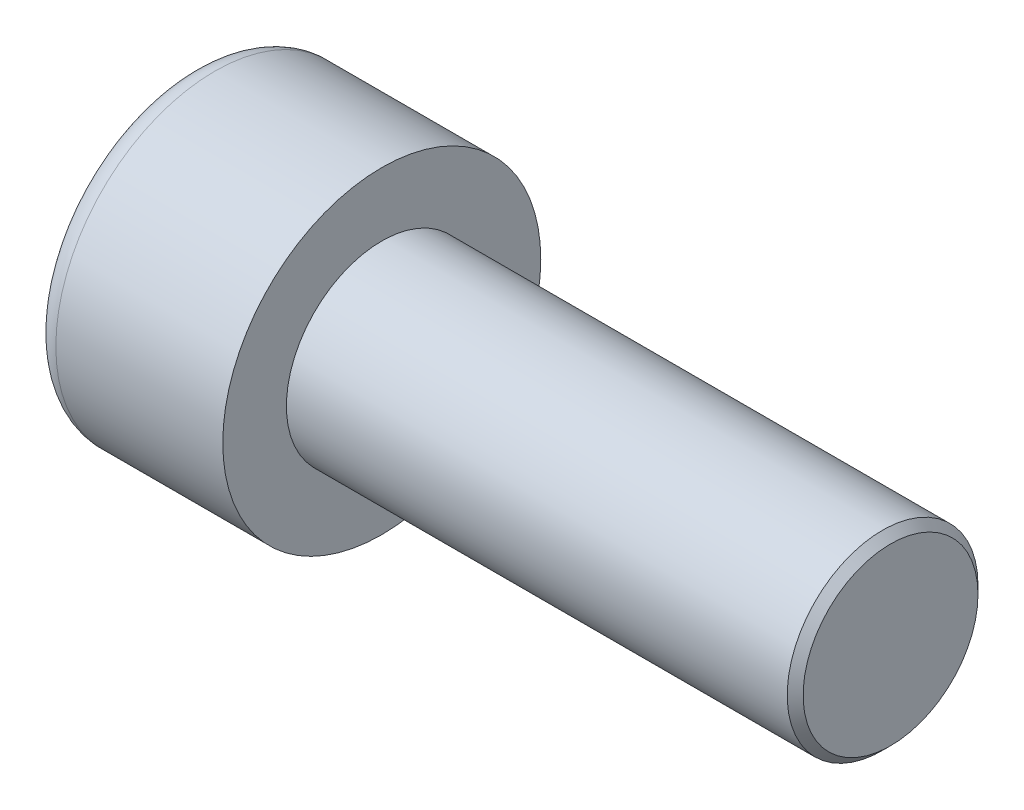
ISO-10303-21;
HEADER;
FILE_DESCRIPTION(('STEP AP214'),'2;1');
FILE_NAME('part.step','',(''),(''),'','','');
FILE_SCHEMA(('AUTOMOTIVE_DESIGN { 1 0 10303 214 1 1 1 1 }'));
ENDSEC;
DATA;
#1=APPLICATION_CONTEXT('core data for automotive mechanical design processes');
#2=APPLICATION_PROTOCOL_DEFINITION('international standard','automotive_design',2000,#1);
#3=PRODUCT_CONTEXT('',#1,'mechanical');
#4=PRODUCT('Part','Part','',(#3));
#5=PRODUCT_RELATED_PRODUCT_CATEGORY('part','',(#4));
#6=PRODUCT_DEFINITION_FORMATION('','',#4);
#7=PRODUCT_DEFINITION_CONTEXT('part definition',#1,'design');
#8=PRODUCT_DEFINITION('design','',#6,#7);
#9=PRODUCT_DEFINITION_SHAPE('','',#8);
#10=(LENGTH_UNIT() NAMED_UNIT(*) SI_UNIT(.MILLI.,.METRE.));
#11=(NAMED_UNIT(*) PLANE_ANGLE_UNIT() SI_UNIT($,.RADIAN.));
#12=(NAMED_UNIT(*) SI_UNIT($,.STERADIAN.) SOLID_ANGLE_UNIT());
#13=UNCERTAINTY_MEASURE_WITH_UNIT(LENGTH_MEASURE(1.E-05),#10,'distance_accuracy_value','');
#14=(GEOMETRIC_REPRESENTATION_CONTEXT(3) GLOBAL_UNCERTAINTY_ASSIGNED_CONTEXT((#13)) GLOBAL_UNIT_ASSIGNED_CONTEXT((#10,
#11,#12)) REPRESENTATION_CONTEXT('',''));
#15=CARTESIAN_POINT('',(0.,0.,0.));
#16=DIRECTION('',(0.,0.,1.));
#17=DIRECTION('',(1.,0.,0.));
#18=AXIS2_PLACEMENT_3D('',#15,#16,#17);
#19=CARTESIAN_POINT('',(3.,0.,-2.88675134594813));
#20=DIRECTION('',(1.,0.,0.));
#21=DIRECTION('',(0.,0.,-1.));
#22=AXIS2_PLACEMENT_3D('',#19,#20,#21);
#23=PLANE('',#22);
#24=CARTESIAN_POINT('',(3.,0.,0.));
#25=DIRECTION('',(1.,0.,0.));
#26=DIRECTION('',(0.,0.,-1.));
#27=AXIS2_PLACEMENT_3D('',#24,#25,#26);
#28=CIRCLE('',#27,2.5);
#29=CARTESIAN_POINT('',(3.,-1.25,-2.1650635094611));
#30=VERTEX_POINT('',#29);
#31=CARTESIAN_POINT('',(3.,-2.5,0.));
#32=VERTEX_POINT('',#31);
#33=EDGE_CURVE('E160',#30,#32,#28,.F.);
#34=ORIENTED_EDGE('',*,*,#33,.F.);
#35=DIRECTION('',(0.,0.866025403784439,-0.5));
#36=VECTOR('',#35,1.);
#37=CARTESIAN_POINT('',(3.,-2.5,-1.44337567297407));
#38=LINE('',#37,#36);
#39=CARTESIAN_POINT('',(3.,-2.5,-1.44337567297407));
#40=VERTEX_POINT('',#39);
#41=EDGE_CURVE('E168',#40,#30,#38,.T.);
#42=ORIENTED_EDGE('',*,*,#41,.F.);
#43=DIRECTION('',(0.,0.,-1.));
#44=VECTOR('',#43,1.);
#45=CARTESIAN_POINT('',(3.,-2.5,1.44337567297406));
#46=LINE('',#45,#44);
#47=EDGE_CURVE('E185',#32,#40,#46,.T.);
#48=ORIENTED_EDGE('',*,*,#47,.F.);
#49=EDGE_LOOP('',(#34,#42,#48));
#50=FACE_BOUND('',#49,.T.);
#51=ADVANCED_FACE('F37',(#50),#23,.F.);
#52=CARTESIAN_POINT('',(3.,-1.25,2.1650635094611));
#53=VERTEX_POINT('',#52);
#54=EDGE_CURVE('E290',#32,#53,#28,.F.);
#55=ORIENTED_EDGE('',*,*,#54,.F.);
#56=CARTESIAN_POINT('',(3.,-2.5,1.44337567297406));
#57=VERTEX_POINT('',#56);
#58=EDGE_CURVE('E186',#57,#32,#46,.T.);
#59=ORIENTED_EDGE('',*,*,#58,.F.);
#60=DIRECTION('',(0.,-0.866025403784438,-0.5));
#61=VECTOR('',#60,1.);
#62=CARTESIAN_POINT('',(3.,0.,2.88675134594813));
#63=LINE('',#62,#61);
#64=EDGE_CURVE('E181',#53,#57,#63,.T.);
#65=ORIENTED_EDGE('',*,*,#64,.F.);
#66=EDGE_LOOP('',(#55,#59,#65));
#67=FACE_BOUND('',#66,.T.);
#68=ADVANCED_FACE('F126',(#67),#23,.F.);
#69=CARTESIAN_POINT('',(3.,1.25,2.1650635094611));
#70=VERTEX_POINT('',#69);
#71=EDGE_CURVE('E286',#53,#70,#28,.F.);
#72=ORIENTED_EDGE('',*,*,#71,.F.);
#73=CARTESIAN_POINT('',(3.,0.,2.88675134594813));
#74=VERTEX_POINT('',#73);
#75=EDGE_CURVE('E182',#74,#53,#63,.T.);
#76=ORIENTED_EDGE('',*,*,#75,.F.);
#77=DIRECTION('',(0.,-0.866025403784439,0.5));
#78=VECTOR('',#77,1.);
#79=CARTESIAN_POINT('',(3.,2.5,1.44337567297406));
#80=LINE('',#79,#78);
#81=EDGE_CURVE('E177',#70,#74,#80,.T.);
#82=ORIENTED_EDGE('',*,*,#81,.F.);
#83=EDGE_LOOP('',(#72,#76,#82));
#84=FACE_BOUND('',#83,.T.);
#85=ADVANCED_FACE('F132',(#84),#23,.F.);
#86=CARTESIAN_POINT('',(3.,2.5,0.));
#87=VERTEX_POINT('',#86);
#88=EDGE_CURVE('E157',#70,#87,#28,.F.);
#89=ORIENTED_EDGE('',*,*,#88,.F.);
#90=CARTESIAN_POINT('',(3.,2.5,1.44337567297406));
#91=VERTEX_POINT('',#90);
#92=EDGE_CURVE('E178',#91,#70,#80,.T.);
#93=ORIENTED_EDGE('',*,*,#92,.F.);
#94=DIRECTION('',(0.,0.,1.));
#95=VECTOR('',#94,1.);
#96=CARTESIAN_POINT('',(3.,2.5,-1.44337567297406));
#97=LINE('',#96,#95);
#98=EDGE_CURVE('E172',#87,#91,#97,.T.);
#99=ORIENTED_EDGE('',*,*,#98,.F.);
#100=EDGE_LOOP('',(#89,#93,#99));
#101=FACE_BOUND('',#100,.T.);
#102=ADVANCED_FACE('F146',(#101),#23,.F.);
#103=CARTESIAN_POINT('',(3.,0.,0.));
#104=DIRECTION('',(1.,0.,0.));
#105=DIRECTION('',(0.,0.,-1.));
#106=AXIS2_PLACEMENT_3D('',#103,#104,#105);
#107=CIRCLE('',#106,2.5);
#108=CARTESIAN_POINT('',(3.,1.25,-2.1650635094611));
#109=VERTEX_POINT('',#108);
#110=EDGE_CURVE('E52',#109,#87,#107,.T.);
#111=ORIENTED_EDGE('',*,*,#110,.T.);
#112=CARTESIAN_POINT('',(3.,2.5,-1.44337567297406));
#113=VERTEX_POINT('',#112);
#114=EDGE_CURVE('E165',#113,#87,#97,.T.);
#115=ORIENTED_EDGE('',*,*,#114,.F.);
#116=DIRECTION('',(0.,0.866025403784438,0.5));
#117=VECTOR('',#116,1.);
#118=CARTESIAN_POINT('',(3.,0.,-2.88675134594813));
#119=LINE('',#118,#117);
#120=EDGE_CURVE('E162',#109,#113,#119,.T.);
#121=ORIENTED_EDGE('',*,*,#120,.F.);
#122=EDGE_LOOP('',(#111,#115,#121));
#123=FACE_BOUND('',#122,.T.);
#124=ADVANCED_FACE('F137',(#123),#23,.F.);
#125=EDGE_CURVE('E150',#109,#30,#28,.F.);
#126=ORIENTED_EDGE('',*,*,#125,.F.);
#127=CARTESIAN_POINT('',(3.,0.,-2.88675134594813));
#128=VERTEX_POINT('',#127);
#129=EDGE_CURVE('E153',#128,#109,#119,.T.);
#130=ORIENTED_EDGE('',*,*,#129,.F.);
#131=EDGE_CURVE('E155',#30,#128,#38,.T.);
#132=ORIENTED_EDGE('',*,*,#131,.F.);
#133=EDGE_LOOP('',(#126,#130,#132));
#134=FACE_BOUND('',#133,.T.);
#135=ADVANCED_FACE('F128',(#134),#23,.F.);
#136=CARTESIAN_POINT('',(0.,0.,0.));
#137=DIRECTION('',(1.,0.,0.));
#138=DIRECTION('',(0.,0.,-1.));
#139=AXIS2_PLACEMENT_3D('',#136,#137,#138);
#140=PLANE('',#139);
#141=CARTESIAN_POINT('',(0.,0.,0.));
#142=DIRECTION('',(1.,0.,0.));
#143=DIRECTION('',(0.,0.,-1.));
#144=AXIS2_PLACEMENT_3D('',#141,#142,#143);
#145=CIRCLE('',#144,4.25);
#146=CARTESIAN_POINT('',(0.,0.,-4.25));
#147=VERTEX_POINT('',#146);
#148=EDGE_CURVE('E225',#147,#147,#145,.F.);
#149=ORIENTED_EDGE('',*,*,#148,.T.);
#150=EDGE_LOOP('',(#149));
#151=FACE_BOUND('',#150,.T.);
#152=DIRECTION('',(0.,0.866025403784439,-0.5));
#153=VECTOR('',#152,1.);
#154=CARTESIAN_POINT('',(0.,-2.5,-1.44337567297407));
#155=LINE('',#154,#153);
#156=CARTESIAN_POINT('',(0.,-2.5,-1.44337567297407));
#157=VERTEX_POINT('',#156);
#158=CARTESIAN_POINT('',(0.,0.,-2.88675134594813));
#159=VERTEX_POINT('',#158);
#160=EDGE_CURVE('E60',#157,#159,#155,.T.);
#161=ORIENTED_EDGE('',*,*,#160,.T.);
#162=DIRECTION('',(0.,0.866025403784438,0.5));
#163=VECTOR('',#162,1.);
#164=CARTESIAN_POINT('',(0.,0.,-2.88675134594813));
#165=LINE('',#164,#163);
#166=CARTESIAN_POINT('',(0.,2.5,-1.44337567297406));
#167=VERTEX_POINT('',#166);
#168=EDGE_CURVE('E191',#159,#167,#165,.T.);
#169=ORIENTED_EDGE('',*,*,#168,.T.);
#170=DIRECTION('',(0.,0.,1.));
#171=VECTOR('',#170,1.);
#172=CARTESIAN_POINT('',(0.,2.5,-1.44337567297406));
#173=LINE('',#172,#171);
#174=CARTESIAN_POINT('',(0.,2.5,1.44337567297406));
#175=VERTEX_POINT('',#174);
#176=EDGE_CURVE('E194',#167,#175,#173,.T.);
#177=ORIENTED_EDGE('',*,*,#176,.T.);
#178=DIRECTION('',(0.,-0.866025403784439,0.5));
#179=VECTOR('',#178,1.);
#180=CARTESIAN_POINT('',(0.,2.5,1.44337567297406));
#181=LINE('',#180,#179);
#182=CARTESIAN_POINT('',(0.,0.,2.88675134594813));
#183=VERTEX_POINT('',#182);
#184=EDGE_CURVE('E197',#175,#183,#181,.T.);
#185=ORIENTED_EDGE('',*,*,#184,.T.);
#186=DIRECTION('',(0.,-0.866025403784438,-0.5));
#187=VECTOR('',#186,1.);
#188=CARTESIAN_POINT('',(0.,0.,2.88675134594813));
#189=LINE('',#188,#187);
#190=CARTESIAN_POINT('',(0.,-2.5,1.44337567297406));
#191=VERTEX_POINT('',#190);
#192=EDGE_CURVE('E200',#183,#191,#189,.T.);
#193=ORIENTED_EDGE('',*,*,#192,.T.);
#194=DIRECTION('',(0.,0.,-1.));
#195=VECTOR('',#194,1.);
#196=CARTESIAN_POINT('',(0.,-2.5,1.44337567297406));
#197=LINE('',#196,#195);
#198=EDGE_CURVE('E203',#191,#157,#197,.T.);
#199=ORIENTED_EDGE('',*,*,#198,.T.);
#200=EDGE_LOOP('',(#161,#169,#177,#185,#193,#199));
#201=FACE_BOUND('',#200,.T.);
#202=ADVANCED_FACE('F136',(#151,#201),#140,.F.);
#203=CARTESIAN_POINT('',(6.,0.,0.));
#204=DIRECTION('',(1.,0.,0.));
#205=DIRECTION('',(0.,0.,-1.));
#206=AXIS2_PLACEMENT_3D('',#203,#204,#205);
#207=PLANE('',#206);
#208=CARTESIAN_POINT('',(6.,0.,0.));
#209=DIRECTION('',(1.,0.,0.));
#210=DIRECTION('',(0.,0.,-1.));
#211=AXIS2_PLACEMENT_3D('',#208,#209,#210);
#212=CIRCLE('',#211,5.);
#213=CARTESIAN_POINT('',(6.,0.,-5.));
#214=VERTEX_POINT('',#213);
#215=EDGE_CURVE('E158',#214,#214,#212,.T.);
#216=ORIENTED_EDGE('',*,*,#215,.T.);
#217=EDGE_LOOP('',(#216));
#218=FACE_BOUND('',#217,.T.);
#219=CARTESIAN_POINT('',(6.,0.,0.));
#220=DIRECTION('',(1.,0.,0.));
#221=DIRECTION('',(0.,0.,-1.));
#222=AXIS2_PLACEMENT_3D('',#219,#220,#221);
#223=CIRCLE('',#222,3.);
#224=CARTESIAN_POINT('',(6.,0.,-3.));
#225=VERTEX_POINT('',#224);
#226=EDGE_CURVE('E216',#225,#225,#223,.T.);
#227=ORIENTED_EDGE('',*,*,#226,.F.);
#228=EDGE_LOOP('',(#227));
#229=FACE_BOUND('',#228,.T.);
#230=ADVANCED_FACE('F143',(#218,#229),#207,.T.);
#231=CARTESIAN_POINT('',(6.,0.,0.));
#232=DIRECTION('',(-1.,0.,0.));
#233=DIRECTION('',(0.,0.,1.));
#234=AXIS2_PLACEMENT_3D('',#231,#232,#233);
#235=CYLINDRICAL_SURFACE('',#234,5.);
#236=CARTESIAN_POINT('',(0.75,0.,0.));
#237=DIRECTION('',(1.,0.,0.));
#238=DIRECTION('',(0.,0.,-1.));
#239=AXIS2_PLACEMENT_3D('',#236,#237,#238);
#240=CIRCLE('',#239,5.);
#241=CARTESIAN_POINT('',(0.75,0.,-5.));
#242=VERTEX_POINT('',#241);
#243=EDGE_CURVE('E222',#242,#242,#240,.T.);
#244=ORIENTED_EDGE('',*,*,#243,.T.);
#245=EDGE_LOOP('',(#244));
#246=FACE_BOUND('',#245,.T.);
#247=ORIENTED_EDGE('',*,*,#215,.F.);
#248=EDGE_LOOP('',(#247));
#249=FACE_BOUND('',#248,.T.);
#250=ADVANCED_FACE('F241',(#246,#249),#235,.T.);
#251=CARTESIAN_POINT('',(22.,0.,0.));
#252=DIRECTION('',(-1.,0.,0.));
#253=DIRECTION('',(0.,0.,1.));
#254=AXIS2_PLACEMENT_3D('',#251,#252,#253);
#255=CYLINDRICAL_SURFACE('',#254,3.);
#256=CARTESIAN_POINT('',(21.75,0.,0.));
#257=DIRECTION('',(1.,0.,0.));
#258=DIRECTION('',(0.,0.,-1.));
#259=AXIS2_PLACEMENT_3D('',#256,#257,#258);
#260=CIRCLE('',#259,3.);
#261=CARTESIAN_POINT('',(21.75,0.,-3.));
#262=VERTEX_POINT('',#261);
#263=EDGE_CURVE('E11',#262,#262,#260,.F.);
#264=ORIENTED_EDGE('',*,*,#263,.T.);
#265=EDGE_LOOP('',(#264));
#266=FACE_BOUND('',#265,.T.);
#267=ORIENTED_EDGE('',*,*,#226,.T.);
#268=EDGE_LOOP('',(#267));
#269=FACE_BOUND('',#268,.T.);
#270=ADVANCED_FACE('F238',(#266,#269),#255,.T.);
#271=CARTESIAN_POINT('',(22.,0.,0.));
#272=DIRECTION('',(1.,0.,0.));
#273=DIRECTION('',(0.,0.,-1.));
#274=AXIS2_PLACEMENT_3D('',#271,#272,#273);
#275=PLANE('',#274);
#276=CARTESIAN_POINT('',(22.,0.,0.));
#277=DIRECTION('',(1.,0.,0.));
#278=DIRECTION('',(0.,0.,-1.));
#279=AXIS2_PLACEMENT_3D('',#276,#277,#278);
#280=CIRCLE('',#279,2.75);
#281=CARTESIAN_POINT('',(22.,0.,-2.75));
#282=VERTEX_POINT('',#281);
#283=EDGE_CURVE('E45',#282,#282,#280,.T.);
#284=ORIENTED_EDGE('',*,*,#283,.T.);
#285=EDGE_LOOP('',(#284));
#286=FACE_BOUND('',#285,.T.);
#287=ADVANCED_FACE('F230',(#286),#275,.T.);
#288=CARTESIAN_POINT('',(3.,-2.5,-1.44337567297407));
#289=DIRECTION('',(0.,0.5,0.866025403784439));
#290=DIRECTION('',(0.,-0.866025403784439,0.5));
#291=AXIS2_PLACEMENT_3D('',#288,#289,#290);
#292=PLANE('',#291);
#293=ORIENTED_EDGE('',*,*,#160,.F.);
#294=DIRECTION('',(-1.,0.,0.));
#295=VECTOR('',#294,1.);
#296=CARTESIAN_POINT('',(3.,-2.5,-1.44337567297407));
#297=LINE('',#296,#295);
#298=EDGE_CURVE('E189',#40,#157,#297,.T.);
#299=ORIENTED_EDGE('',*,*,#298,.F.);
#300=ORIENTED_EDGE('',*,*,#41,.T.);
#301=ORIENTED_EDGE('',*,*,#131,.T.);
#302=DIRECTION('',(-1.,0.,0.));
#303=VECTOR('',#302,1.);
#304=CARTESIAN_POINT('',(3.,0.,-2.88675134594813));
#305=LINE('',#304,#303);
#306=EDGE_CURVE('E171',#128,#159,#305,.T.);
#307=ORIENTED_EDGE('',*,*,#306,.T.);
#308=EDGE_LOOP('',(#293,#299,#300,#301,#307));
#309=FACE_BOUND('',#308,.T.);
#310=ADVANCED_FACE('F256',(#309),#292,.T.);
#311=CARTESIAN_POINT('',(3.,0.,-2.88675134594813));
#312=DIRECTION('',(0.,-0.5,0.866025403784438));
#313=DIRECTION('',(0.,-0.866025403784439,-0.5));
#314=AXIS2_PLACEMENT_3D('',#311,#312,#313);
#315=PLANE('',#314);
#316=ORIENTED_EDGE('',*,*,#168,.F.);
#317=ORIENTED_EDGE('',*,*,#306,.F.);
#318=ORIENTED_EDGE('',*,*,#129,.T.);
#319=ORIENTED_EDGE('',*,*,#120,.T.);
#320=DIRECTION('',(-1.,0.,0.));
#321=VECTOR('',#320,1.);
#322=CARTESIAN_POINT('',(3.,2.5,-1.44337567297406));
#323=LINE('',#322,#321);
#324=EDGE_CURVE('E213',#113,#167,#323,.T.);
#325=ORIENTED_EDGE('',*,*,#324,.T.);
#326=EDGE_LOOP('',(#316,#317,#318,#319,#325));
#327=FACE_BOUND('',#326,.T.);
#328=ADVANCED_FACE('F170',(#327),#315,.T.);
#329=CARTESIAN_POINT('',(3.,2.5,-1.44337567297406));
#330=DIRECTION('',(0.,-1.,0.));
#331=DIRECTION('',(0.,0.,-1.));
#332=AXIS2_PLACEMENT_3D('',#329,#330,#331);
#333=PLANE('',#332);
#334=ORIENTED_EDGE('',*,*,#176,.F.);
#335=ORIENTED_EDGE('',*,*,#324,.F.);
#336=ORIENTED_EDGE('',*,*,#114,.T.);
#337=ORIENTED_EDGE('',*,*,#98,.T.);
#338=DIRECTION('',(-1.,0.,0.));
#339=VECTOR('',#338,1.);
#340=CARTESIAN_POINT('',(3.,2.5,1.44337567297406));
#341=LINE('',#340,#339);
#342=EDGE_CURVE('E211',#91,#175,#341,.T.);
#343=ORIENTED_EDGE('',*,*,#342,.T.);
#344=EDGE_LOOP('',(#334,#335,#336,#337,#343));
#345=FACE_BOUND('',#344,.T.);
#346=ADVANCED_FACE('F261',(#345),#333,.T.);
#347=CARTESIAN_POINT('',(3.,2.5,1.44337567297406));
#348=DIRECTION('',(0.,-0.5,-0.866025403784439));
#349=DIRECTION('',(0.,0.866025403784439,-0.5));
#350=AXIS2_PLACEMENT_3D('',#347,#348,#349);
#351=PLANE('',#350);
#352=ORIENTED_EDGE('',*,*,#184,.F.);
#353=ORIENTED_EDGE('',*,*,#342,.F.);
#354=ORIENTED_EDGE('',*,*,#92,.T.);
#355=ORIENTED_EDGE('',*,*,#81,.T.);
#356=DIRECTION('',(-1.,0.,0.));
#357=VECTOR('',#356,1.);
#358=CARTESIAN_POINT('',(3.,0.,2.88675134594813));
#359=LINE('',#358,#357);
#360=EDGE_CURVE('E209',#74,#183,#359,.T.);
#361=ORIENTED_EDGE('',*,*,#360,.T.);
#362=EDGE_LOOP('',(#352,#353,#354,#355,#361));
#363=FACE_BOUND('',#362,.T.);
#364=ADVANCED_FACE('F264',(#363),#351,.T.);
#365=CARTESIAN_POINT('',(3.,0.,2.88675134594813));
#366=DIRECTION('',(0.,0.5,-0.866025403784439));
#367=DIRECTION('',(0.,0.866025403784439,0.5));
#368=AXIS2_PLACEMENT_3D('',#365,#366,#367);
#369=PLANE('',#368);
#370=ORIENTED_EDGE('',*,*,#192,.F.);
#371=ORIENTED_EDGE('',*,*,#360,.F.);
#372=ORIENTED_EDGE('',*,*,#75,.T.);
#373=ORIENTED_EDGE('',*,*,#64,.T.);
#374=DIRECTION('',(-1.,0.,0.));
#375=VECTOR('',#374,1.);
#376=CARTESIAN_POINT('',(3.,-2.5,1.44337567297406));
#377=LINE('',#376,#375);
#378=EDGE_CURVE('E207',#57,#191,#377,.T.);
#379=ORIENTED_EDGE('',*,*,#378,.T.);
#380=EDGE_LOOP('',(#370,#371,#372,#373,#379));
#381=FACE_BOUND('',#380,.T.);
#382=ADVANCED_FACE('F121',(#381),#369,.T.);
#383=CARTESIAN_POINT('',(3.,-2.5,1.44337567297406));
#384=DIRECTION('',(0.,1.,0.));
#385=DIRECTION('',(0.,0.,1.));
#386=AXIS2_PLACEMENT_3D('',#383,#384,#385);
#387=PLANE('',#386);
#388=ORIENTED_EDGE('',*,*,#198,.F.);
#389=ORIENTED_EDGE('',*,*,#378,.F.);
#390=ORIENTED_EDGE('',*,*,#58,.T.);
#391=ORIENTED_EDGE('',*,*,#47,.T.);
#392=ORIENTED_EDGE('',*,*,#298,.T.);
#393=EDGE_LOOP('',(#388,#389,#390,#391,#392));
#394=FACE_BOUND('',#393,.T.);
#395=ADVANCED_FACE('F114',(#394),#387,.T.);
#396=CARTESIAN_POINT('',(3.,0.,0.));
#397=DIRECTION('',(-1.,0.,0.));
#398=DIRECTION('',(0.,0.,1.));
#399=AXIS2_PLACEMENT_3D('',#396,#397,#398);
#400=CONICAL_SURFACE('',#399,2.5,1.04719755119659);
#401=CARTESIAN_POINT('',(4.44337567297408,0.,0.));
#402=VERTEX_POINT('',#401);
#403=VERTEX_LOOP('',#402);
#404=FACE_BOUND('',#403,.T.);
#405=ORIENTED_EDGE('',*,*,#110,.F.);
#406=ORIENTED_EDGE('',*,*,#125,.T.);
#407=ORIENTED_EDGE('',*,*,#33,.T.);
#408=ORIENTED_EDGE('',*,*,#54,.T.);
#409=ORIENTED_EDGE('',*,*,#71,.T.);
#410=ORIENTED_EDGE('',*,*,#88,.T.);
#411=EDGE_LOOP('',(#405,#406,#407,#408,#409,#410));
#412=FACE_BOUND('',#411,.T.);
#413=ADVANCED_FACE('F111',(#404,#412),#400,.F.);
#414=CARTESIAN_POINT('',(0.75,0.,0.));
#415=DIRECTION('',(1.,0.,0.));
#416=DIRECTION('',(0.,0.,-1.));
#417=AXIS2_PLACEMENT_3D('',#414,#415,#416);
#418=TOROIDAL_SURFACE('',#417,4.25,0.75);
#419=ORIENTED_EDGE('',*,*,#148,.F.);
#420=EDGE_LOOP('',(#419));
#421=FACE_BOUND('',#420,.T.);
#422=ORIENTED_EDGE('',*,*,#243,.F.);
#423=EDGE_LOOP('',(#422));
#424=FACE_BOUND('',#423,.T.);
#425=ADVANCED_FACE('F113',(#421,#424),#418,.T.);
#426=CARTESIAN_POINT('',(22.,0.,0.));
#427=DIRECTION('',(-1.,0.,0.));
#428=DIRECTION('',(0.,0.,1.));
#429=AXIS2_PLACEMENT_3D('',#426,#427,#428);
#430=CONICAL_SURFACE('',#429,2.75,0.785398163397444);
#431=ORIENTED_EDGE('',*,*,#263,.F.);
#432=EDGE_LOOP('',(#431));
#433=FACE_BOUND('',#432,.T.);
#434=ORIENTED_EDGE('',*,*,#283,.F.);
#435=EDGE_LOOP('',(#434));
#436=FACE_BOUND('',#435,.T.);
#437=ADVANCED_FACE('F39',(#433,#436),#430,.T.);
#438=CLOSED_SHELL('',(#51,#68,#85,#102,#124,#135,#202,#230,#250,#270,#287,#310,#328,#346,#364,
#382,#395,#413,#425,#437));
#439=MANIFOLD_SOLID_BREP('B2',#438);
#440=ADVANCED_BREP_SHAPE_REPRESENTATION('',(#18,#439),#14);
#441=SHAPE_DEFINITION_REPRESENTATION(#9,#440);
ENDSEC;
END-ISO-10303-21;
